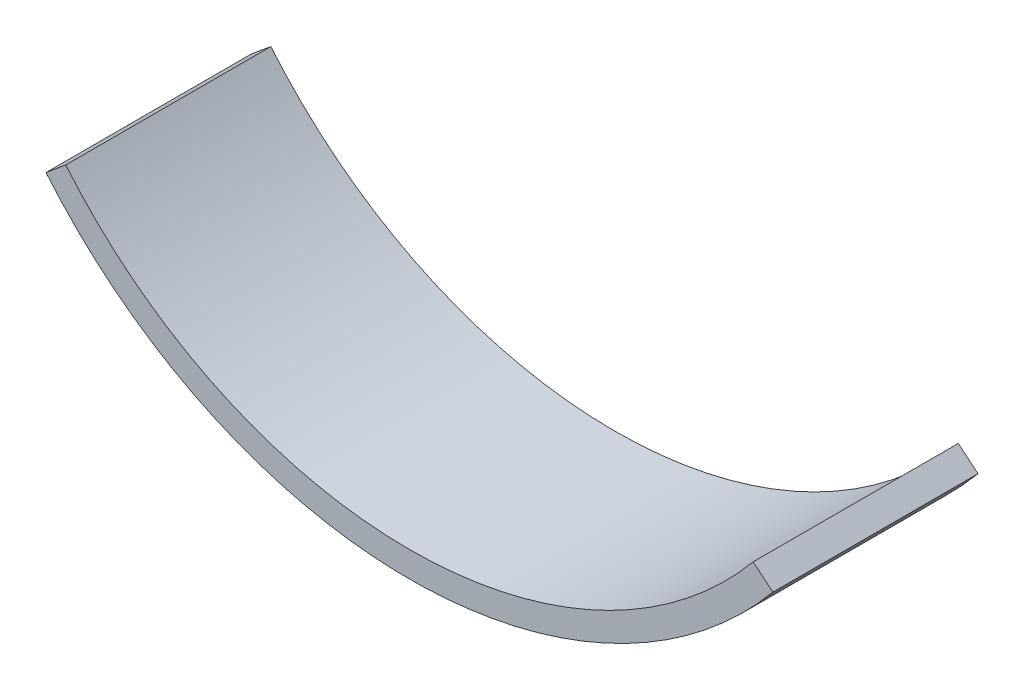
ISO-10303-21;
HEADER;
FILE_DESCRIPTION(('STEP AP214'),'2;1');
FILE_NAME('part.step','',(''),(''),'','','');
FILE_SCHEMA(('AUTOMOTIVE_DESIGN { 1 0 10303 214 1 1 1 1 }'));
ENDSEC;
DATA;
#1=APPLICATION_CONTEXT('core data for automotive mechanical design processes');
#2=APPLICATION_PROTOCOL_DEFINITION('international standard','automotive_design',2000,#1);
#3=PRODUCT_CONTEXT('',#1,'mechanical');
#4=PRODUCT('Part','Part','',(#3));
#5=PRODUCT_RELATED_PRODUCT_CATEGORY('part','',(#4));
#6=PRODUCT_DEFINITION_FORMATION('','',#4);
#7=PRODUCT_DEFINITION_CONTEXT('part definition',#1,'design');
#8=PRODUCT_DEFINITION('design','',#6,#7);
#9=PRODUCT_DEFINITION_SHAPE('','',#8);
#10=(LENGTH_UNIT() NAMED_UNIT(*) SI_UNIT(.MILLI.,.METRE.));
#11=(NAMED_UNIT(*) PLANE_ANGLE_UNIT() SI_UNIT($,.RADIAN.));
#12=(NAMED_UNIT(*) SI_UNIT($,.STERADIAN.) SOLID_ANGLE_UNIT());
#13=UNCERTAINTY_MEASURE_WITH_UNIT(LENGTH_MEASURE(1.E-05),#10,'distance_accuracy_value','');
#14=(GEOMETRIC_REPRESENTATION_CONTEXT(3) GLOBAL_UNCERTAINTY_ASSIGNED_CONTEXT((#13)) GLOBAL_UNIT_ASSIGNED_CONTEXT((#10,
#11,#12)) REPRESENTATION_CONTEXT('',''));
#15=CARTESIAN_POINT('',(0.,0.,0.));
#16=DIRECTION('',(0.,0.,1.));
#17=DIRECTION('',(1.,0.,0.));
#18=AXIS2_PLACEMENT_3D('',#15,#16,#17);
#19=CARTESIAN_POINT('',(45.,37.4501939247316,25.4));
#20=DIRECTION('',(0.,0.,-1.));
#21=DIRECTION('',(-1.,0.,0.));
#22=AXIS2_PLACEMENT_3D('',#19,#20,#21);
#23=CYLINDRICAL_SURFACE('',#22,58.545);
#24=CARTESIAN_POINT('',(45.,37.4501939247316,0.));
#25=DIRECTION('',(0.,0.,1.));
#26=DIRECTION('',(1.,0.,0.));
#27=AXIS2_PLACEMENT_3D('',#24,#25,#26);
#28=CIRCLE('',#27,58.545);
#29=CARTESIAN_POINT('',(0.,0.,0.));
#30=VERTEX_POINT('',#29);
#31=CARTESIAN_POINT('',(90.,0.,0.));
#32=VERTEX_POINT('',#31);
#33=EDGE_CURVE('E99',#30,#32,#28,.T.);
#34=ORIENTED_EDGE('',*,*,#33,.T.);
#35=DIRECTION('',(0.,0.,-1.));
#36=VECTOR('',#35,1.);
#37=CARTESIAN_POINT('',(90.,0.,25.4));
#38=LINE('',#37,#36);
#39=CARTESIAN_POINT('',(90.,0.,25.4));
#40=VERTEX_POINT('',#39);
#41=EDGE_CURVE('E11',#40,#32,#38,.T.);
#42=ORIENTED_EDGE('',*,*,#41,.F.);
#43=CARTESIAN_POINT('',(45.,37.4501939247316,25.4));
#44=DIRECTION('',(0.,0.,1.));
#45=DIRECTION('',(1.,0.,0.));
#46=AXIS2_PLACEMENT_3D('',#43,#44,#45);
#47=CIRCLE('',#46,58.545);
#48=CARTESIAN_POINT('',(0.,0.,25.4));
#49=VERTEX_POINT('',#48);
#50=EDGE_CURVE('E87',#49,#40,#47,.T.);
#51=ORIENTED_EDGE('',*,*,#50,.F.);
#52=DIRECTION('',(0.,0.,-1.));
#53=VECTOR('',#52,1.);
#54=CARTESIAN_POINT('',(0.,0.,25.4));
#55=LINE('',#54,#53);
#56=EDGE_CURVE('E95',#49,#30,#55,.T.);
#57=ORIENTED_EDGE('',*,*,#56,.T.);
#58=EDGE_LOOP('',(#34,#42,#51,#57));
#59=FACE_BOUND('',#58,.T.);
#60=ADVANCED_FACE('F36',(#59),#23,.T.);
#61=CARTESIAN_POINT('',(87.5595695618755,2.03099095927958,25.4));
#62=DIRECTION('',(-0.639682191899077,-0.768639508070716,0.));
#63=DIRECTION('',(0.768639508070716,-0.639682191899077,0.));
#64=AXIS2_PLACEMENT_3D('',#61,#62,#63);
#65=PLANE('',#64);
#66=DIRECTION('',(-0.768639508070716,0.639682191899077,0.));
#67=VECTOR('',#66,1.);
#68=CARTESIAN_POINT('',(87.5595695618755,2.03099095927958,0.));
#69=LINE('',#68,#67);
#70=CARTESIAN_POINT('',(87.5595695618754,2.03099095927956,0.));
#71=VERTEX_POINT('',#70);
#72=EDGE_CURVE('E91',#32,#71,#69,.T.);
#73=ORIENTED_EDGE('',*,*,#72,.T.);
#74=DIRECTION('',(0.,0.,-1.));
#75=VECTOR('',#74,1.);
#76=CARTESIAN_POINT('',(87.5595695618754,2.03099095927956,25.4));
#77=LINE('',#76,#75);
#78=CARTESIAN_POINT('',(87.5595695618754,2.03099095927956,25.4));
#79=VERTEX_POINT('',#78);
#80=EDGE_CURVE('E44',#79,#71,#77,.T.);
#81=ORIENTED_EDGE('',*,*,#80,.F.);
#82=DIRECTION('',(-0.768639508070716,0.639682191899077,0.));
#83=VECTOR('',#82,1.);
#84=CARTESIAN_POINT('',(87.5595695618755,2.03099095927958,25.4));
#85=LINE('',#84,#83);
#86=EDGE_CURVE('E82',#40,#79,#85,.T.);
#87=ORIENTED_EDGE('',*,*,#86,.F.);
#88=ORIENTED_EDGE('',*,*,#41,.T.);
#89=EDGE_LOOP('',(#73,#81,#87,#88));
#90=FACE_BOUND('',#89,.T.);
#91=ADVANCED_FACE('F90',(#90),#65,.F.);
#92=CARTESIAN_POINT('',(45.,37.4501939247316,25.4));
#93=DIRECTION('',(0.,0.,-1.));
#94=DIRECTION('',(-1.,0.,0.));
#95=AXIS2_PLACEMENT_3D('',#92,#93,#94);
#96=CYLINDRICAL_SURFACE('',#95,55.37);
#97=CARTESIAN_POINT('',(45.,37.4501939247316,0.));
#98=DIRECTION('',(0.,0.,-1.));
#99=DIRECTION('',(1.,0.,0.));
#100=AXIS2_PLACEMENT_3D('',#97,#98,#99);
#101=CIRCLE('',#100,55.37);
#102=CARTESIAN_POINT('',(2.44043043812452,2.03099095927958,0.));
#103=VERTEX_POINT('',#102);
#104=EDGE_CURVE('E69',#71,#103,#101,.T.);
#105=ORIENTED_EDGE('',*,*,#104,.T.);
#106=DIRECTION('',(0.,0.,-1.));
#107=VECTOR('',#106,1.);
#108=CARTESIAN_POINT('',(2.44043043812452,2.03099095927958,25.4));
#109=LINE('',#108,#107);
#110=CARTESIAN_POINT('',(2.44043043812452,2.03099095927958,25.4));
#111=VERTEX_POINT('',#110);
#112=EDGE_CURVE('E92',#111,#103,#109,.T.);
#113=ORIENTED_EDGE('',*,*,#112,.F.);
#114=CARTESIAN_POINT('',(45.,37.4501939247316,25.4));
#115=DIRECTION('',(0.,0.,-1.));
#116=DIRECTION('',(1.,0.,0.));
#117=AXIS2_PLACEMENT_3D('',#114,#115,#116);
#118=CIRCLE('',#117,55.37);
#119=EDGE_CURVE('E85',#79,#111,#118,.T.);
#120=ORIENTED_EDGE('',*,*,#119,.F.);
#121=ORIENTED_EDGE('',*,*,#80,.T.);
#122=EDGE_LOOP('',(#105,#113,#120,#121));
#123=FACE_BOUND('',#122,.T.);
#124=ADVANCED_FACE('F93',(#123),#96,.F.);
#125=CARTESIAN_POINT('',(0.,0.,25.4));
#126=DIRECTION('',(0.639682191899081,-0.768639508070713,0.));
#127=DIRECTION('',(0.768639508070713,0.639682191899081,0.));
#128=AXIS2_PLACEMENT_3D('',#125,#126,#127);
#129=PLANE('',#128);
#130=DIRECTION('',(-0.768639508070713,-0.639682191899081,0.));
#131=VECTOR('',#130,1.);
#132=CARTESIAN_POINT('',(0.,0.,0.));
#133=LINE('',#132,#131);
#134=EDGE_CURVE('E75',#103,#30,#133,.T.);
#135=ORIENTED_EDGE('',*,*,#134,.T.);
#136=ORIENTED_EDGE('',*,*,#56,.F.);
#137=DIRECTION('',(-0.768639508070713,-0.639682191899081,0.));
#138=VECTOR('',#137,1.);
#139=CARTESIAN_POINT('',(0.,0.,25.4));
#140=LINE('',#139,#138);
#141=EDGE_CURVE('E52',#111,#49,#140,.T.);
#142=ORIENTED_EDGE('',*,*,#141,.F.);
#143=ORIENTED_EDGE('',*,*,#112,.T.);
#144=EDGE_LOOP('',(#135,#136,#142,#143));
#145=FACE_BOUND('',#144,.T.);
#146=ADVANCED_FACE('F106',(#145),#129,.F.);
#147=CARTESIAN_POINT('',(45.,37.4501939247316,25.4));
#148=DIRECTION('',(0.,0.,1.));
#149=DIRECTION('',(1.,0.,0.));
#150=AXIS2_PLACEMENT_3D('',#147,#148,#149);
#151=PLANE('',#150);
#152=ORIENTED_EDGE('',*,*,#50,.T.);
#153=ORIENTED_EDGE('',*,*,#86,.T.);
#154=ORIENTED_EDGE('',*,*,#119,.T.);
#155=ORIENTED_EDGE('',*,*,#141,.T.);
#156=EDGE_LOOP('',(#152,#153,#154,#155));
#157=FACE_BOUND('',#156,.T.);
#158=ADVANCED_FACE('F83',(#157),#151,.T.);
#159=CARTESIAN_POINT('',(45.,37.4501939247316,0.));
#160=DIRECTION('',(0.,0.,1.));
#161=DIRECTION('',(1.,0.,0.));
#162=AXIS2_PLACEMENT_3D('',#159,#160,#161);
#163=PLANE('',#162);
#164=ORIENTED_EDGE('',*,*,#33,.F.);
#165=ORIENTED_EDGE('',*,*,#134,.F.);
#166=ORIENTED_EDGE('',*,*,#104,.F.);
#167=ORIENTED_EDGE('',*,*,#72,.F.);
#168=EDGE_LOOP('',(#164,#165,#166,#167));
#169=FACE_BOUND('',#168,.T.);
#170=ADVANCED_FACE('F109',(#169),#163,.F.);
#171=CLOSED_SHELL('',(#60,#91,#124,#146,#158,#170));
#172=MANIFOLD_SOLID_BREP('B2',#171);
#173=ADVANCED_BREP_SHAPE_REPRESENTATION('',(#18,#172),#14);
#174=SHAPE_DEFINITION_REPRESENTATION(#9,#173);
ENDSEC;
END-ISO-10303-21;
